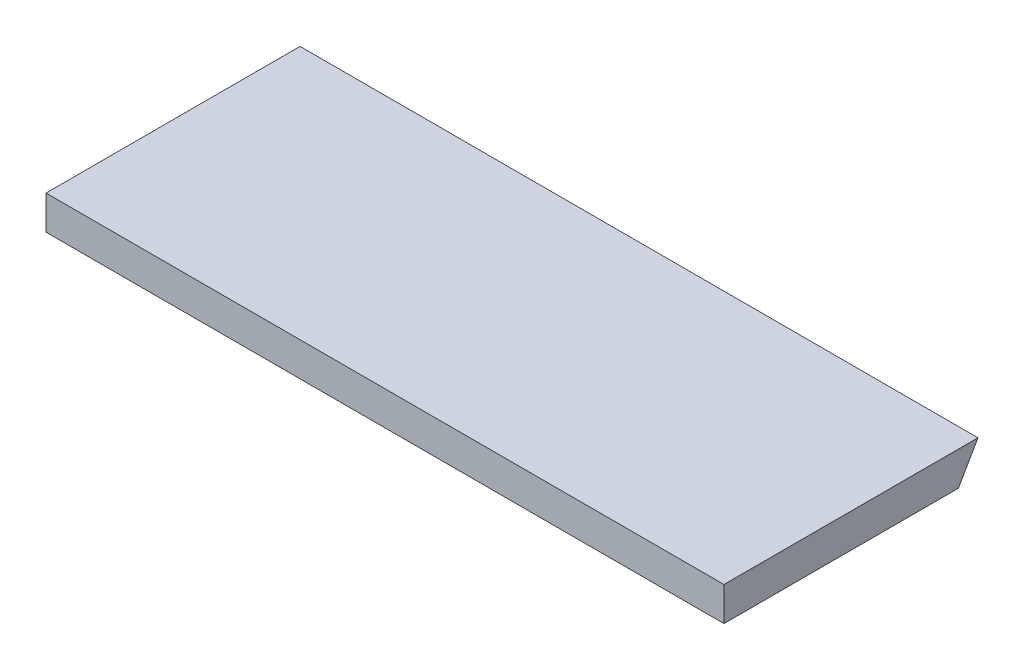
ISO-10303-21;
HEADER;
FILE_DESCRIPTION(('STEP AP214'),'2;1');
FILE_NAME('part.step','',(''),(''),'','','');
FILE_SCHEMA(('AUTOMOTIVE_DESIGN { 1 0 10303 214 1 1 1 1 }'));
ENDSEC;
DATA;
#1=APPLICATION_CONTEXT('core data for automotive mechanical design processes');
#2=APPLICATION_PROTOCOL_DEFINITION('international standard','automotive_design',2000,#1);
#3=PRODUCT_CONTEXT('',#1,'mechanical');
#4=PRODUCT('Part','Part','',(#3));
#5=PRODUCT_RELATED_PRODUCT_CATEGORY('part','',(#4));
#6=PRODUCT_DEFINITION_FORMATION('','',#4);
#7=PRODUCT_DEFINITION_CONTEXT('part definition',#1,'design');
#8=PRODUCT_DEFINITION('design','',#6,#7);
#9=PRODUCT_DEFINITION_SHAPE('','',#8);
#10=(LENGTH_UNIT() NAMED_UNIT(*) SI_UNIT(.MILLI.,.METRE.));
#11=(NAMED_UNIT(*) PLANE_ANGLE_UNIT() SI_UNIT($,.RADIAN.));
#12=(NAMED_UNIT(*) SI_UNIT($,.STERADIAN.) SOLID_ANGLE_UNIT());
#13=UNCERTAINTY_MEASURE_WITH_UNIT(LENGTH_MEASURE(1.E-05),#10,'distance_accuracy_value','');
#14=(GEOMETRIC_REPRESENTATION_CONTEXT(3) GLOBAL_UNCERTAINTY_ASSIGNED_CONTEXT((#13)) GLOBAL_UNIT_ASSIGNED_CONTEXT((#10,
#11,#12)) REPRESENTATION_CONTEXT('',''));
#15=CARTESIAN_POINT('',(0.,0.,0.));
#16=DIRECTION('',(0.,0.,1.));
#17=DIRECTION('',(1.,0.,0.));
#18=AXIS2_PLACEMENT_3D('',#15,#16,#17);
#19=CARTESIAN_POINT('',(337.437494211891,-164.89100675807,-6.72833609155446));
#20=DIRECTION('',(0.,0.500000000000003,0.866025403784437));
#21=DIRECTION('',(0.,-0.866025403784437,0.500000000000003));
#22=AXIS2_PLACEMENT_3D('',#19,#20,#21);
#23=PLANE('',#22);
#24=DIRECTION('',(-1.,0.,0.));
#25=VECTOR('',#24,1.);
#26=CARTESIAN_POINT('',(-240.,-12.,-95.));
#27=LINE('',#26,#25);
#28=CARTESIAN_POINT('',(0.,-12.,-95.));
#29=VERTEX_POINT('',#28);
#30=CARTESIAN_POINT('',(-240.,-12.,-95.));
#31=VERTEX_POINT('',#30);
#32=EDGE_CURVE('E81',#29,#31,#27,.T.);
#33=ORIENTED_EDGE('',*,*,#32,.T.);
#34=DIRECTION('',(0.,0.866025403784437,-0.500000000000003));
#35=VECTOR('',#34,1.);
#36=CARTESIAN_POINT('',(-240.,-44.1362066797611,-76.4461524227064));
#37=LINE('',#36,#35);
#38=CARTESIAN_POINT('',(-240.,0.,-101.928203230276));
#39=VERTEX_POINT('',#38);
#40=EDGE_CURVE('E90',#31,#39,#37,.T.);
#41=ORIENTED_EDGE('',*,*,#40,.T.);
#42=DIRECTION('',(1.,0.,0.));
#43=VECTOR('',#42,1.);
#44=CARTESIAN_POINT('',(-240.,0.,-101.928203230276));
#45=LINE('',#44,#43);
#46=CARTESIAN_POINT('',(0.,0.,-101.928203230276));
#47=VERTEX_POINT('',#46);
#48=EDGE_CURVE('E47',#39,#47,#45,.T.);
#49=ORIENTED_EDGE('',*,*,#48,.T.);
#50=DIRECTION('',(0.,0.866025403784437,-0.500000000000003));
#51=VECTOR('',#50,1.);
#52=CARTESIAN_POINT('',(0.,-44.1362066797611,-76.4461524227064));
#53=LINE('',#52,#51);
#54=EDGE_CURVE('E11',#29,#47,#53,.T.);
#55=ORIENTED_EDGE('',*,*,#54,.F.);
#56=EDGE_LOOP('',(#33,#41,#49,#55));
#57=FACE_BOUND('',#56,.T.);
#58=ADVANCED_FACE('F32',(#57),#23,.F.);
#59=CARTESIAN_POINT('',(-240.,0.,-12.));
#60=DIRECTION('',(0.,1.,0.));
#61=DIRECTION('',(0.,0.,1.));
#62=AXIS2_PLACEMENT_3D('',#59,#60,#61);
#63=PLANE('',#62);
#64=ORIENTED_EDGE('',*,*,#48,.F.);
#65=DIRECTION('',(0.,0.,1.));
#66=VECTOR('',#65,1.);
#67=CARTESIAN_POINT('',(-240.,0.,-12.));
#68=LINE('',#67,#66);
#69=CARTESIAN_POINT('',(-240.,0.,-12.));
#70=VERTEX_POINT('',#69);
#71=EDGE_CURVE('E83',#39,#70,#68,.T.);
#72=ORIENTED_EDGE('',*,*,#71,.T.);
#73=DIRECTION('',(1.,0.,0.));
#74=VECTOR('',#73,1.);
#75=CARTESIAN_POINT('',(-240.,0.,-12.));
#76=LINE('',#75,#74);
#77=CARTESIAN_POINT('',(0.,0.,-12.));
#78=VERTEX_POINT('',#77);
#79=EDGE_CURVE('E73',#70,#78,#76,.T.);
#80=ORIENTED_EDGE('',*,*,#79,.T.);
#81=DIRECTION('',(0.,0.,1.));
#82=VECTOR('',#81,1.);
#83=CARTESIAN_POINT('',(0.,0.,-12.));
#84=LINE('',#83,#82);
#85=EDGE_CURVE('E87',#47,#78,#84,.T.);
#86=ORIENTED_EDGE('',*,*,#85,.F.);
#87=EDGE_LOOP('',(#64,#72,#80,#86));
#88=FACE_BOUND('',#87,.T.);
#89=ADVANCED_FACE('F34',(#88),#63,.T.);
#90=CARTESIAN_POINT('',(-240.,-12.,-12.));
#91=DIRECTION('',(0.,-1.,0.));
#92=DIRECTION('',(0.,0.,-1.));
#93=AXIS2_PLACEMENT_3D('',#90,#91,#92);
#94=PLANE('',#93);
#95=ORIENTED_EDGE('',*,*,#32,.F.);
#96=DIRECTION('',(0.,0.,-1.));
#97=VECTOR('',#96,1.);
#98=CARTESIAN_POINT('',(0.,-12.,-12.));
#99=LINE('',#98,#97);
#100=CARTESIAN_POINT('',(0.,-12.,-12.));
#101=VERTEX_POINT('',#100);
#102=EDGE_CURVE('E77',#101,#29,#99,.T.);
#103=ORIENTED_EDGE('',*,*,#102,.F.);
#104=DIRECTION('',(1.,0.,0.));
#105=VECTOR('',#104,1.);
#106=CARTESIAN_POINT('',(-240.,-12.,-12.));
#107=LINE('',#106,#105);
#108=CARTESIAN_POINT('',(-240.,-12.,-12.));
#109=VERTEX_POINT('',#108);
#110=EDGE_CURVE('E40',#109,#101,#107,.T.);
#111=ORIENTED_EDGE('',*,*,#110,.F.);
#112=DIRECTION('',(0.,0.,-1.));
#113=VECTOR('',#112,1.);
#114=CARTESIAN_POINT('',(-240.,-12.,-12.));
#115=LINE('',#114,#113);
#116=EDGE_CURVE('E93',#109,#31,#115,.T.);
#117=ORIENTED_EDGE('',*,*,#116,.T.);
#118=EDGE_LOOP('',(#95,#103,#111,#117));
#119=FACE_BOUND('',#118,.T.);
#120=ADVANCED_FACE('F78',(#119),#94,.T.);
#121=CARTESIAN_POINT('',(-240.,-12.,-12.));
#122=DIRECTION('',(0.,0.,1.));
#123=DIRECTION('',(1.,0.,0.));
#124=AXIS2_PLACEMENT_3D('',#121,#122,#123);
#125=PLANE('',#124);
#126=DIRECTION('',(0.,-1.,0.));
#127=VECTOR('',#126,1.);
#128=CARTESIAN_POINT('',(0.,-12.,-12.));
#129=LINE('',#128,#127);
#130=EDGE_CURVE('E70',#78,#101,#129,.T.);
#131=ORIENTED_EDGE('',*,*,#130,.F.);
#132=ORIENTED_EDGE('',*,*,#79,.F.);
#133=DIRECTION('',(0.,-1.,0.));
#134=VECTOR('',#133,1.);
#135=CARTESIAN_POINT('',(-240.,-12.,-12.));
#136=LINE('',#135,#134);
#137=EDGE_CURVE('E72',#70,#109,#136,.T.);
#138=ORIENTED_EDGE('',*,*,#137,.T.);
#139=ORIENTED_EDGE('',*,*,#110,.T.);
#140=EDGE_LOOP('',(#131,#132,#138,#139));
#141=FACE_BOUND('',#140,.T.);
#142=ADVANCED_FACE('F67',(#141),#125,.T.);
#143=CARTESIAN_POINT('',(-240.,0.,0.));
#144=DIRECTION('',(-1.,0.,0.));
#145=DIRECTION('',(0.,0.,1.));
#146=AXIS2_PLACEMENT_3D('',#143,#144,#145);
#147=PLANE('',#146);
#148=ORIENTED_EDGE('',*,*,#40,.F.);
#149=ORIENTED_EDGE('',*,*,#116,.F.);
#150=ORIENTED_EDGE('',*,*,#137,.F.);
#151=ORIENTED_EDGE('',*,*,#71,.F.);
#152=EDGE_LOOP('',(#148,#149,#150,#151));
#153=FACE_BOUND('',#152,.T.);
#154=ADVANCED_FACE('F105',(#153),#147,.T.);
#155=CARTESIAN_POINT('',(0.,0.,0.));
#156=DIRECTION('',(-1.,0.,0.));
#157=DIRECTION('',(0.,0.,1.));
#158=AXIS2_PLACEMENT_3D('',#155,#156,#157);
#159=PLANE('',#158);
#160=ORIENTED_EDGE('',*,*,#102,.T.);
#161=ORIENTED_EDGE('',*,*,#54,.T.);
#162=ORIENTED_EDGE('',*,*,#85,.T.);
#163=ORIENTED_EDGE('',*,*,#130,.T.);
#164=EDGE_LOOP('',(#160,#161,#162,#163));
#165=FACE_BOUND('',#164,.T.);
#166=ADVANCED_FACE('F85',(#165),#159,.F.);
#167=CLOSED_SHELL('',(#58,#89,#120,#142,#154,#166));
#168=MANIFOLD_SOLID_BREP('B2',#167);
#169=ADVANCED_BREP_SHAPE_REPRESENTATION('',(#18,#168),#14);
#170=SHAPE_DEFINITION_REPRESENTATION(#9,#169);
ENDSEC;
END-ISO-10303-21;
